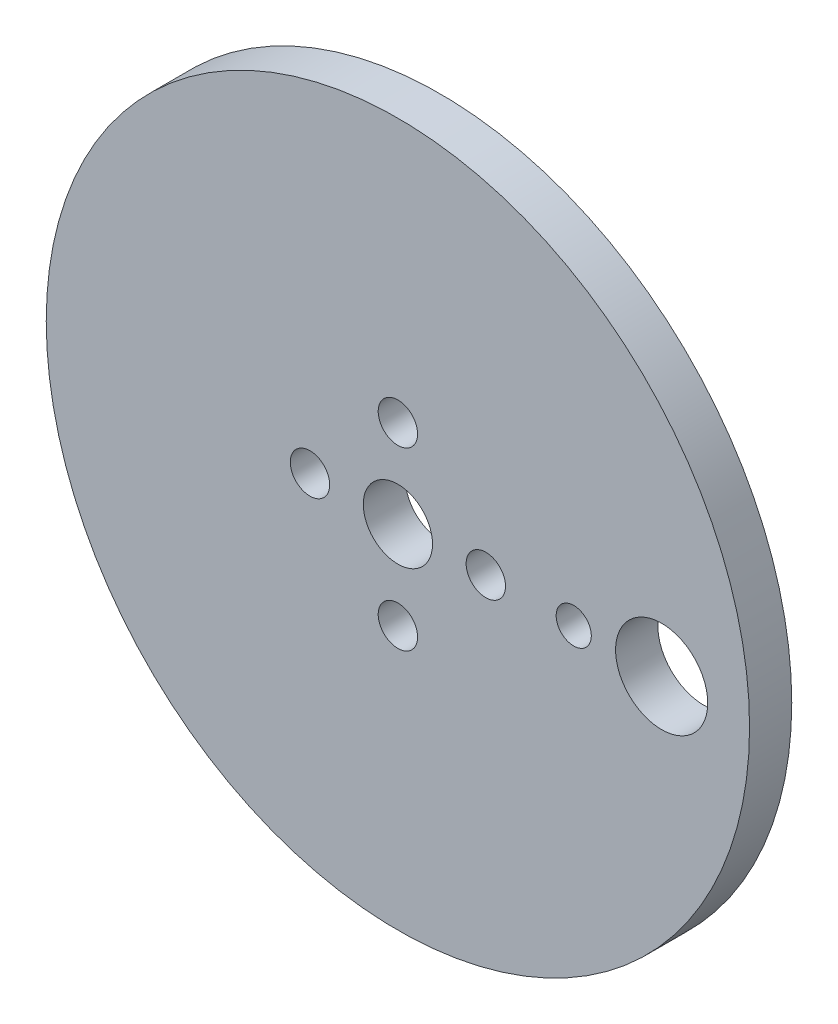
ISO-10303-21;
HEADER;
FILE_DESCRIPTION(('STEP AP214'),'2;1');
FILE_NAME('part.step','',(''),(''),'','','');
FILE_SCHEMA(('AUTOMOTIVE_DESIGN { 1 0 10303 214 1 1 1 1 }'));
ENDSEC;
DATA;
#1=APPLICATION_CONTEXT('core data for automotive mechanical design processes');
#2=APPLICATION_PROTOCOL_DEFINITION('international standard','automotive_design',2000,#1);
#3=PRODUCT_CONTEXT('',#1,'mechanical');
#4=PRODUCT('Part','Part','',(#3));
#5=PRODUCT_RELATED_PRODUCT_CATEGORY('part','',(#4));
#6=PRODUCT_DEFINITION_FORMATION('','',#4);
#7=PRODUCT_DEFINITION_CONTEXT('part definition',#1,'design');
#8=PRODUCT_DEFINITION('design','',#6,#7);
#9=PRODUCT_DEFINITION_SHAPE('','',#8);
#10=(LENGTH_UNIT() NAMED_UNIT(*) SI_UNIT(.MILLI.,.METRE.));
#11=(NAMED_UNIT(*) PLANE_ANGLE_UNIT() SI_UNIT($,.RADIAN.));
#12=(NAMED_UNIT(*) SI_UNIT($,.STERADIAN.) SOLID_ANGLE_UNIT());
#13=UNCERTAINTY_MEASURE_WITH_UNIT(LENGTH_MEASURE(1.E-05),#10,'distance_accuracy_value','');
#14=(GEOMETRIC_REPRESENTATION_CONTEXT(3) GLOBAL_UNCERTAINTY_ASSIGNED_CONTEXT((#13)) GLOBAL_UNIT_ASSIGNED_CONTEXT((#10,
#11,#12)) REPRESENTATION_CONTEXT('',''));
#15=CARTESIAN_POINT('',(0.,0.,0.));
#16=DIRECTION('',(0.,0.,1.));
#17=DIRECTION('',(1.,0.,0.));
#18=AXIS2_PLACEMENT_3D('',#15,#16,#17);
#19=CARTESIAN_POINT('',(0.,0.,3.048));
#20=DIRECTION('',(0.,0.,1.));
#21=DIRECTION('',(1.,0.,0.));
#22=AXIS2_PLACEMENT_3D('',#19,#20,#21);
#23=PLANE('',#22);
#24=CARTESIAN_POINT('',(19.05,0.,3.048));
#25=DIRECTION('',(0.,0.,1.));
#26=DIRECTION('',(1.,0.,0.));
#27=AXIS2_PLACEMENT_3D('',#24,#25,#26);
#28=CIRCLE('',#27,3.3274);
#29=CARTESIAN_POINT('',(22.3774,0.,3.048));
#30=VERTEX_POINT('',#29);
#31=EDGE_CURVE('E71',#30,#30,#28,.T.);
#32=ORIENTED_EDGE('',*,*,#31,.F.);
#33=EDGE_LOOP('',(#32));
#34=FACE_BOUND('',#33,.T.);
#35=CARTESIAN_POINT('',(0.,-6.35,3.048));
#36=DIRECTION('',(0.,0.,1.));
#37=DIRECTION('',(1.,0.,0.));
#38=AXIS2_PLACEMENT_3D('',#35,#36,#37);
#39=CIRCLE('',#38,1.4224);
#40=CARTESIAN_POINT('',(1.4224,-6.35,3.048));
#41=VERTEX_POINT('',#40);
#42=EDGE_CURVE('E59',#41,#41,#39,.T.);
#43=ORIENTED_EDGE('',*,*,#42,.F.);
#44=EDGE_LOOP('',(#43));
#45=FACE_BOUND('',#44,.T.);
#46=CARTESIAN_POINT('',(0.,0.,3.048));
#47=DIRECTION('',(0.,0.,1.));
#48=DIRECTION('',(1.,0.,0.));
#49=AXIS2_PLACEMENT_3D('',#46,#47,#48);
#50=CIRCLE('',#49,2.5);
#51=CARTESIAN_POINT('',(2.5,0.,3.048));
#52=VERTEX_POINT('',#51);
#53=EDGE_CURVE('E47',#52,#52,#50,.T.);
#54=ORIENTED_EDGE('',*,*,#53,.F.);
#55=EDGE_LOOP('',(#54));
#56=FACE_BOUND('',#55,.T.);
#57=CARTESIAN_POINT('',(0.,0.,3.048));
#58=DIRECTION('',(0.,0.,1.));
#59=DIRECTION('',(1.,0.,0.));
#60=AXIS2_PLACEMENT_3D('',#57,#58,#59);
#61=CIRCLE('',#60,25.4);
#62=CARTESIAN_POINT('',(25.4,0.,3.048));
#63=VERTEX_POINT('',#62);
#64=EDGE_CURVE('E10',#63,#63,#61,.T.);
#65=ORIENTED_EDGE('',*,*,#64,.T.);
#66=EDGE_LOOP('',(#65));
#67=FACE_BOUND('',#66,.T.);
#68=CARTESIAN_POINT('',(0.,6.35,3.048));
#69=DIRECTION('',(0.,0.,1.));
#70=DIRECTION('',(1.,0.,0.));
#71=AXIS2_PLACEMENT_3D('',#68,#69,#70);
#72=CIRCLE('',#71,1.4224);
#73=CARTESIAN_POINT('',(1.4224,6.35,3.048));
#74=VERTEX_POINT('',#73);
#75=EDGE_CURVE('E42',#74,#74,#72,.T.);
#76=ORIENTED_EDGE('',*,*,#75,.F.);
#77=EDGE_LOOP('',(#76));
#78=FACE_BOUND('',#77,.T.);
#79=CARTESIAN_POINT('',(6.35,0.,3.048));
#80=DIRECTION('',(0.,0.,1.));
#81=DIRECTION('',(1.,0.,0.));
#82=AXIS2_PLACEMENT_3D('',#79,#80,#81);
#83=CIRCLE('',#82,1.4224);
#84=CARTESIAN_POINT('',(7.7724,0.,3.048));
#85=VERTEX_POINT('',#84);
#86=EDGE_CURVE('E53',#85,#85,#83,.T.);
#87=ORIENTED_EDGE('',*,*,#86,.F.);
#88=EDGE_LOOP('',(#87));
#89=FACE_BOUND('',#88,.T.);
#90=CARTESIAN_POINT('',(-6.35,0.,3.048));
#91=DIRECTION('',(0.,0.,1.));
#92=DIRECTION('',(1.,0.,0.));
#93=AXIS2_PLACEMENT_3D('',#90,#91,#92);
#94=CIRCLE('',#93,1.4224);
#95=CARTESIAN_POINT('',(-4.9276,0.,3.048));
#96=VERTEX_POINT('',#95);
#97=EDGE_CURVE('E65',#96,#96,#94,.T.);
#98=ORIENTED_EDGE('',*,*,#97,.F.);
#99=EDGE_LOOP('',(#98));
#100=FACE_BOUND('',#99,.T.);
#101=CARTESIAN_POINT('',(12.7,0.,3.048));
#102=DIRECTION('',(0.,0.,1.));
#103=DIRECTION('',(1.,0.,0.));
#104=AXIS2_PLACEMENT_3D('',#101,#102,#103);
#105=CIRCLE('',#104,1.27);
#106=CARTESIAN_POINT('',(13.97,0.,3.048));
#107=VERTEX_POINT('',#106);
#108=EDGE_CURVE('E77',#107,#107,#105,.T.);
#109=ORIENTED_EDGE('',*,*,#108,.F.);
#110=EDGE_LOOP('',(#109));
#111=FACE_BOUND('',#110,.T.);
#112=ADVANCED_FACE('F31',(#34,#45,#56,#67,#78,#89,#100,#111),#23,.T.);
#113=CARTESIAN_POINT('',(0.,0.,0.));
#114=DIRECTION('',(0.,0.,1.));
#115=DIRECTION('',(1.,0.,0.));
#116=AXIS2_PLACEMENT_3D('',#113,#114,#115);
#117=PLANE('',#116);
#118=CARTESIAN_POINT('',(19.05,0.,0.));
#119=DIRECTION('',(0.,0.,1.));
#120=DIRECTION('',(1.,0.,0.));
#121=AXIS2_PLACEMENT_3D('',#118,#119,#120);
#122=CIRCLE('',#121,3.3274);
#123=CARTESIAN_POINT('',(22.3774,0.,0.));
#124=VERTEX_POINT('',#123);
#125=EDGE_CURVE('E74',#124,#124,#122,.T.);
#126=ORIENTED_EDGE('',*,*,#125,.T.);
#127=EDGE_LOOP('',(#126));
#128=FACE_BOUND('',#127,.T.);
#129=CARTESIAN_POINT('',(0.,-6.35,0.));
#130=DIRECTION('',(0.,0.,1.));
#131=DIRECTION('',(1.,0.,0.));
#132=AXIS2_PLACEMENT_3D('',#129,#130,#131);
#133=CIRCLE('',#132,1.4224);
#134=CARTESIAN_POINT('',(1.4224,-6.35,0.));
#135=VERTEX_POINT('',#134);
#136=EDGE_CURVE('E62',#135,#135,#133,.T.);
#137=ORIENTED_EDGE('',*,*,#136,.T.);
#138=EDGE_LOOP('',(#137));
#139=FACE_BOUND('',#138,.T.);
#140=CARTESIAN_POINT('',(0.,0.,0.));
#141=DIRECTION('',(0.,0.,1.));
#142=DIRECTION('',(1.,0.,0.));
#143=AXIS2_PLACEMENT_3D('',#140,#141,#142);
#144=CIRCLE('',#143,2.5);
#145=CARTESIAN_POINT('',(2.5,0.,0.));
#146=VERTEX_POINT('',#145);
#147=EDGE_CURVE('E50',#146,#146,#144,.T.);
#148=ORIENTED_EDGE('',*,*,#147,.T.);
#149=EDGE_LOOP('',(#148));
#150=FACE_BOUND('',#149,.T.);
#151=CARTESIAN_POINT('',(0.,0.,0.));
#152=DIRECTION('',(0.,0.,1.));
#153=DIRECTION('',(1.,0.,0.));
#154=AXIS2_PLACEMENT_3D('',#151,#152,#153);
#155=CIRCLE('',#154,25.4);
#156=CARTESIAN_POINT('',(25.4,0.,0.));
#157=VERTEX_POINT('',#156);
#158=EDGE_CURVE('E35',#157,#157,#155,.T.);
#159=ORIENTED_EDGE('',*,*,#158,.F.);
#160=EDGE_LOOP('',(#159));
#161=FACE_BOUND('',#160,.T.);
#162=CARTESIAN_POINT('',(0.,6.35,0.));
#163=DIRECTION('',(0.,0.,1.));
#164=DIRECTION('',(1.,0.,0.));
#165=AXIS2_PLACEMENT_3D('',#162,#163,#164);
#166=CIRCLE('',#165,1.4224);
#167=CARTESIAN_POINT('',(1.4224,6.35,0.));
#168=VERTEX_POINT('',#167);
#169=EDGE_CURVE('E44',#168,#168,#166,.T.);
#170=ORIENTED_EDGE('',*,*,#169,.T.);
#171=EDGE_LOOP('',(#170));
#172=FACE_BOUND('',#171,.T.);
#173=CARTESIAN_POINT('',(6.35,0.,0.));
#174=DIRECTION('',(0.,0.,1.));
#175=DIRECTION('',(1.,0.,0.));
#176=AXIS2_PLACEMENT_3D('',#173,#174,#175);
#177=CIRCLE('',#176,1.4224);
#178=CARTESIAN_POINT('',(7.7724,0.,0.));
#179=VERTEX_POINT('',#178);
#180=EDGE_CURVE('E56',#179,#179,#177,.T.);
#181=ORIENTED_EDGE('',*,*,#180,.T.);
#182=EDGE_LOOP('',(#181));
#183=FACE_BOUND('',#182,.T.);
#184=CARTESIAN_POINT('',(-6.35,0.,0.));
#185=DIRECTION('',(0.,0.,1.));
#186=DIRECTION('',(1.,0.,0.));
#187=AXIS2_PLACEMENT_3D('',#184,#185,#186);
#188=CIRCLE('',#187,1.4224);
#189=CARTESIAN_POINT('',(-4.9276,0.,0.));
#190=VERTEX_POINT('',#189);
#191=EDGE_CURVE('E68',#190,#190,#188,.T.);
#192=ORIENTED_EDGE('',*,*,#191,.T.);
#193=EDGE_LOOP('',(#192));
#194=FACE_BOUND('',#193,.T.);
#195=CARTESIAN_POINT('',(12.7,0.,0.));
#196=DIRECTION('',(0.,0.,1.));
#197=DIRECTION('',(1.,0.,0.));
#198=AXIS2_PLACEMENT_3D('',#195,#196,#197);
#199=CIRCLE('',#198,1.27);
#200=CARTESIAN_POINT('',(13.97,0.,0.));
#201=VERTEX_POINT('',#200);
#202=EDGE_CURVE('E80',#201,#201,#199,.T.);
#203=ORIENTED_EDGE('',*,*,#202,.T.);
#204=EDGE_LOOP('',(#203));
#205=FACE_BOUND('',#204,.T.);
#206=ADVANCED_FACE('F90',(#128,#139,#150,#161,#172,#183,#194,#205),#117,.F.);
#207=CARTESIAN_POINT('',(0.,0.,3.048));
#208=DIRECTION('',(0.,0.,-1.));
#209=DIRECTION('',(-1.,0.,0.));
#210=AXIS2_PLACEMENT_3D('',#207,#208,#209);
#211=CYLINDRICAL_SURFACE('',#210,25.4);
#212=ORIENTED_EDGE('',*,*,#64,.F.);
#213=EDGE_LOOP('',(#212));
#214=FACE_BOUND('',#213,.T.);
#215=ORIENTED_EDGE('',*,*,#158,.T.);
#216=EDGE_LOOP('',(#215));
#217=FACE_BOUND('',#216,.T.);
#218=ADVANCED_FACE('F33',(#214,#217),#211,.T.);
#219=CARTESIAN_POINT('',(0.,6.35,3.048));
#220=DIRECTION('',(0.,0.,-1.));
#221=DIRECTION('',(-1.,0.,0.));
#222=AXIS2_PLACEMENT_3D('',#219,#220,#221);
#223=CYLINDRICAL_SURFACE('',#222,1.4224);
#224=ORIENTED_EDGE('',*,*,#75,.T.);
#225=EDGE_LOOP('',(#224));
#226=FACE_BOUND('',#225,.T.);
#227=ORIENTED_EDGE('',*,*,#169,.F.);
#228=EDGE_LOOP('',(#227));
#229=FACE_BOUND('',#228,.T.);
#230=ADVANCED_FACE('F100',(#226,#229),#223,.F.);
#231=CARTESIAN_POINT('',(0.,0.,3.048));
#232=DIRECTION('',(0.,0.,-1.));
#233=DIRECTION('',(-1.,0.,0.));
#234=AXIS2_PLACEMENT_3D('',#231,#232,#233);
#235=CYLINDRICAL_SURFACE('',#234,2.5);
#236=ORIENTED_EDGE('',*,*,#53,.T.);
#237=EDGE_LOOP('',(#236));
#238=FACE_BOUND('',#237,.T.);
#239=ORIENTED_EDGE('',*,*,#147,.F.);
#240=EDGE_LOOP('',(#239));
#241=FACE_BOUND('',#240,.T.);
#242=ADVANCED_FACE('F103',(#238,#241),#235,.F.);
#243=CARTESIAN_POINT('',(6.35,0.,3.048));
#244=DIRECTION('',(0.,0.,-1.));
#245=DIRECTION('',(-1.,0.,0.));
#246=AXIS2_PLACEMENT_3D('',#243,#244,#245);
#247=CYLINDRICAL_SURFACE('',#246,1.4224);
#248=ORIENTED_EDGE('',*,*,#86,.T.);
#249=EDGE_LOOP('',(#248));
#250=FACE_BOUND('',#249,.T.);
#251=ORIENTED_EDGE('',*,*,#180,.F.);
#252=EDGE_LOOP('',(#251));
#253=FACE_BOUND('',#252,.T.);
#254=ADVANCED_FACE('F107',(#250,#253),#247,.F.);
#255=CARTESIAN_POINT('',(0.,-6.35,3.048));
#256=DIRECTION('',(0.,0.,-1.));
#257=DIRECTION('',(-1.,0.,0.));
#258=AXIS2_PLACEMENT_3D('',#255,#256,#257);
#259=CYLINDRICAL_SURFACE('',#258,1.4224);
#260=ORIENTED_EDGE('',*,*,#42,.T.);
#261=EDGE_LOOP('',(#260));
#262=FACE_BOUND('',#261,.T.);
#263=ORIENTED_EDGE('',*,*,#136,.F.);
#264=EDGE_LOOP('',(#263));
#265=FACE_BOUND('',#264,.T.);
#266=ADVANCED_FACE('F111',(#262,#265),#259,.F.);
#267=CARTESIAN_POINT('',(-6.35,0.,3.048));
#268=DIRECTION('',(0.,0.,-1.));
#269=DIRECTION('',(-1.,0.,0.));
#270=AXIS2_PLACEMENT_3D('',#267,#268,#269);
#271=CYLINDRICAL_SURFACE('',#270,1.4224);
#272=ORIENTED_EDGE('',*,*,#97,.T.);
#273=EDGE_LOOP('',(#272));
#274=FACE_BOUND('',#273,.T.);
#275=ORIENTED_EDGE('',*,*,#191,.F.);
#276=EDGE_LOOP('',(#275));
#277=FACE_BOUND('',#276,.T.);
#278=ADVANCED_FACE('F115',(#274,#277),#271,.F.);
#279=CARTESIAN_POINT('',(19.05,0.,3.048));
#280=DIRECTION('',(0.,0.,-1.));
#281=DIRECTION('',(-1.,0.,0.));
#282=AXIS2_PLACEMENT_3D('',#279,#280,#281);
#283=CYLINDRICAL_SURFACE('',#282,3.3274);
#284=ORIENTED_EDGE('',*,*,#31,.T.);
#285=EDGE_LOOP('',(#284));
#286=FACE_BOUND('',#285,.T.);
#287=ORIENTED_EDGE('',*,*,#125,.F.);
#288=EDGE_LOOP('',(#287));
#289=FACE_BOUND('',#288,.T.);
#290=ADVANCED_FACE('F119',(#286,#289),#283,.F.);
#291=CARTESIAN_POINT('',(12.7,0.,3.048));
#292=DIRECTION('',(0.,0.,-1.));
#293=DIRECTION('',(-1.,0.,0.));
#294=AXIS2_PLACEMENT_3D('',#291,#292,#293);
#295=CYLINDRICAL_SURFACE('',#294,1.27);
#296=ORIENTED_EDGE('',*,*,#108,.T.);
#297=EDGE_LOOP('',(#296));
#298=FACE_BOUND('',#297,.T.);
#299=ORIENTED_EDGE('',*,*,#202,.F.);
#300=EDGE_LOOP('',(#299));
#301=FACE_BOUND('',#300,.T.);
#302=ADVANCED_FACE('F86',(#298,#301),#295,.F.);
#303=CLOSED_SHELL('',(#112,#206,#218,#230,#242,#254,#266,#278,#290,#302));
#304=MANIFOLD_SOLID_BREP('B2',#303);
#305=ADVANCED_BREP_SHAPE_REPRESENTATION('',(#18,#304),#14);
#306=SHAPE_DEFINITION_REPRESENTATION(#9,#305);
ENDSEC;
END-ISO-10303-21;
